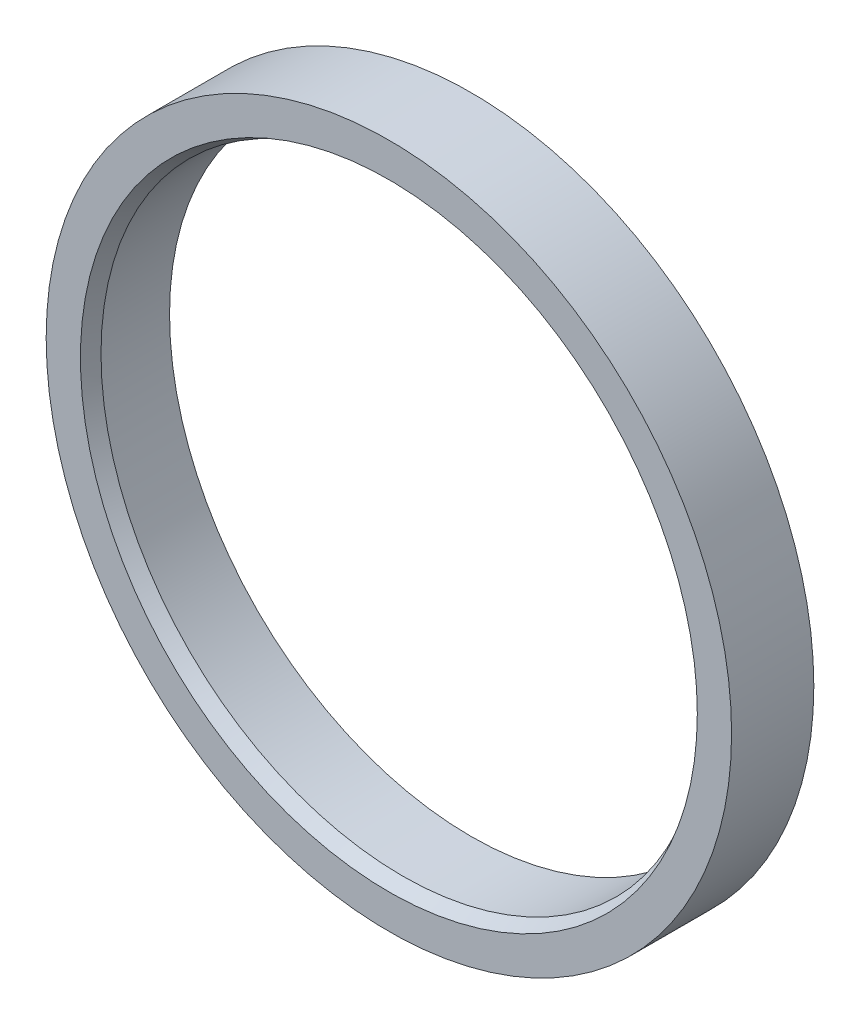
ISO-10303-21;
HEADER;
FILE_DESCRIPTION(('STEP AP214'),'2;1');
FILE_NAME('part.step','',(''),(''),'','','');
FILE_SCHEMA(('AUTOMOTIVE_DESIGN { 1 0 10303 214 1 1 1 1 }'));
ENDSEC;
DATA;
#1=APPLICATION_CONTEXT('core data for automotive mechanical design processes');
#2=APPLICATION_PROTOCOL_DEFINITION('international standard','automotive_design',2000,#1);
#3=PRODUCT_CONTEXT('',#1,'mechanical');
#4=PRODUCT('Part','Part','',(#3));
#5=PRODUCT_RELATED_PRODUCT_CATEGORY('part','',(#4));
#6=PRODUCT_DEFINITION_FORMATION('','',#4);
#7=PRODUCT_DEFINITION_CONTEXT('part definition',#1,'design');
#8=PRODUCT_DEFINITION('design','',#6,#7);
#9=PRODUCT_DEFINITION_SHAPE('','',#8);
#10=(LENGTH_UNIT() NAMED_UNIT(*) SI_UNIT(.MILLI.,.METRE.));
#11=(NAMED_UNIT(*) PLANE_ANGLE_UNIT() SI_UNIT($,.RADIAN.));
#12=(NAMED_UNIT(*) SI_UNIT($,.STERADIAN.) SOLID_ANGLE_UNIT());
#13=UNCERTAINTY_MEASURE_WITH_UNIT(LENGTH_MEASURE(1.E-05),#10,'distance_accuracy_value','');
#14=(GEOMETRIC_REPRESENTATION_CONTEXT(3) GLOBAL_UNCERTAINTY_ASSIGNED_CONTEXT((#13)) GLOBAL_UNIT_ASSIGNED_CONTEXT((#10,
#11,#12)) REPRESENTATION_CONTEXT('',''));
#15=CARTESIAN_POINT('',(0.,0.,0.));
#16=DIRECTION('',(0.,0.,1.));
#17=DIRECTION('',(1.,0.,0.));
#18=AXIS2_PLACEMENT_3D('',#15,#16,#17);
#19=CARTESIAN_POINT('',(0.,0.,-19.05));
#20=DIRECTION('',(0.,0.,-1.));
#21=DIRECTION('',(-1.,0.,0.));
#22=AXIS2_PLACEMENT_3D('',#19,#20,#21);
#23=PLANE('',#22);
#24=CARTESIAN_POINT('',(0.,0.,-19.05));
#25=DIRECTION('',(0.,0.,1.));
#26=DIRECTION('',(1.,0.,0.));
#27=AXIS2_PLACEMENT_3D('',#24,#25,#26);
#28=CIRCLE('',#27,69.85);
#29=CARTESIAN_POINT('',(69.85,0.,-19.05));
#30=VERTEX_POINT('',#29);
#31=EDGE_CURVE('E68',#30,#30,#28,.T.);
#32=ORIENTED_EDGE('',*,*,#31,.T.);
#33=EDGE_LOOP('',(#32));
#34=FACE_BOUND('',#33,.T.);
#35=CARTESIAN_POINT('',(0.,0.,-19.05));
#36=DIRECTION('',(0.,0.,1.));
#37=DIRECTION('',(1.,0.,0.));
#38=AXIS2_PLACEMENT_3D('',#35,#36,#37);
#39=CIRCLE('',#38,72.23125);
#40=CARTESIAN_POINT('',(72.23125,0.,-19.05));
#41=VERTEX_POINT('',#40);
#42=EDGE_CURVE('E10',#41,#41,#39,.T.);
#43=ORIENTED_EDGE('',*,*,#42,.F.);
#44=EDGE_LOOP('',(#43));
#45=FACE_BOUND('',#44,.T.);
#46=ADVANCED_FACE('F37',(#34,#45),#23,.T.);
#47=CARTESIAN_POINT('',(0.,0.,0.));
#48=DIRECTION('',(0.,0.,1.));
#49=DIRECTION('',(1.,0.,0.));
#50=AXIS2_PLACEMENT_3D('',#47,#48,#49);
#51=CYLINDRICAL_SURFACE('',#50,72.23125);
#52=ORIENTED_EDGE('',*,*,#42,.T.);
#53=EDGE_LOOP('',(#52));
#54=FACE_BOUND('',#53,.T.);
#55=CARTESIAN_POINT('',(0.,0.,-9.525));
#56=DIRECTION('',(0.,0.,1.));
#57=DIRECTION('',(1.,0.,0.));
#58=AXIS2_PLACEMENT_3D('',#55,#56,#57);
#59=CIRCLE('',#58,72.23125);
#60=CARTESIAN_POINT('',(72.23125,0.,-9.525));
#61=VERTEX_POINT('',#60);
#62=EDGE_CURVE('E43',#61,#61,#59,.T.);
#63=ORIENTED_EDGE('',*,*,#62,.F.);
#64=EDGE_LOOP('',(#63));
#65=FACE_BOUND('',#64,.T.);
#66=ADVANCED_FACE('F98',(#54,#65),#51,.T.);
#67=CARTESIAN_POINT('',(0.,0.,-9.525));
#68=DIRECTION('',(0.,0.,-1.));
#69=DIRECTION('',(-1.,0.,0.));
#70=AXIS2_PLACEMENT_3D('',#67,#68,#69);
#71=PLANE('',#70);
#72=ORIENTED_EDGE('',*,*,#62,.T.);
#73=EDGE_LOOP('',(#72));
#74=FACE_BOUND('',#73,.T.);
#75=CARTESIAN_POINT('',(0.,0.,-9.525));
#76=DIRECTION('',(0.,0.,1.));
#77=DIRECTION('',(1.,0.,0.));
#78=AXIS2_PLACEMENT_3D('',#75,#76,#77);
#79=CIRCLE('',#78,76.2);
#80=CARTESIAN_POINT('',(76.2,0.,-9.525));
#81=VERTEX_POINT('',#80);
#82=EDGE_CURVE('E47',#81,#81,#79,.T.);
#83=ORIENTED_EDGE('',*,*,#82,.F.);
#84=EDGE_LOOP('',(#83));
#85=FACE_BOUND('',#84,.T.);
#86=ADVANCED_FACE('F102',(#74,#85),#71,.T.);
#87=CARTESIAN_POINT('',(0.,0.,0.));
#88=DIRECTION('',(0.,0.,1.));
#89=DIRECTION('',(1.,0.,0.));
#90=AXIS2_PLACEMENT_3D('',#87,#88,#89);
#91=CYLINDRICAL_SURFACE('',#90,76.2);
#92=ORIENTED_EDGE('',*,*,#82,.T.);
#93=EDGE_LOOP('',(#92));
#94=FACE_BOUND('',#93,.T.);
#95=CARTESIAN_POINT('',(0.,0.,-19.05));
#96=DIRECTION('',(0.,0.,1.));
#97=DIRECTION('',(1.,0.,0.));
#98=AXIS2_PLACEMENT_3D('',#95,#96,#97);
#99=CIRCLE('',#98,76.2);
#100=CARTESIAN_POINT('',(76.2,0.,-19.05));
#101=VERTEX_POINT('',#100);
#102=EDGE_CURVE('E51',#101,#101,#99,.T.);
#103=ORIENTED_EDGE('',*,*,#102,.F.);
#104=EDGE_LOOP('',(#103));
#105=FACE_BOUND('',#104,.T.);
#106=ADVANCED_FACE('F106',(#94,#105),#91,.F.);
#107=CARTESIAN_POINT('',(0.,0.,-19.05));
#108=DIRECTION('',(0.,0.,-1.));
#109=DIRECTION('',(-1.,0.,0.));
#110=AXIS2_PLACEMENT_3D('',#107,#108,#109);
#111=PLANE('',#110);
#112=ORIENTED_EDGE('',*,*,#102,.T.);
#113=EDGE_LOOP('',(#112));
#114=FACE_BOUND('',#113,.T.);
#115=CARTESIAN_POINT('',(0.,0.,-19.05));
#116=DIRECTION('',(0.,0.,1.));
#117=DIRECTION('',(1.,0.,0.));
#118=AXIS2_PLACEMENT_3D('',#115,#116,#117);
#119=CIRCLE('',#118,79.375);
#120=CARTESIAN_POINT('',(79.375,0.,-19.05));
#121=VERTEX_POINT('',#120);
#122=EDGE_CURVE('E56',#121,#121,#119,.T.);
#123=ORIENTED_EDGE('',*,*,#122,.F.);
#124=EDGE_LOOP('',(#123));
#125=FACE_BOUND('',#124,.T.);
#126=ADVANCED_FACE('F94',(#114,#125),#111,.T.);
#127=CARTESIAN_POINT('',(0.,0.,0.));
#128=DIRECTION('',(0.,0.,1.));
#129=DIRECTION('',(1.,0.,0.));
#130=AXIS2_PLACEMENT_3D('',#127,#128,#129);
#131=CYLINDRICAL_SURFACE('',#130,79.375);
#132=ORIENTED_EDGE('',*,*,#122,.T.);
#133=EDGE_LOOP('',(#132));
#134=FACE_BOUND('',#133,.T.);
#135=CARTESIAN_POINT('',(0.,0.,0.));
#136=DIRECTION('',(0.,0.,1.));
#137=DIRECTION('',(1.,0.,0.));
#138=AXIS2_PLACEMENT_3D('',#135,#136,#137);
#139=CIRCLE('',#138,79.375);
#140=CARTESIAN_POINT('',(79.375,0.,0.));
#141=VERTEX_POINT('',#140);
#142=EDGE_CURVE('E59',#141,#141,#139,.T.);
#143=ORIENTED_EDGE('',*,*,#142,.F.);
#144=EDGE_LOOP('',(#143));
#145=FACE_BOUND('',#144,.T.);
#146=ADVANCED_FACE('F88',(#134,#145),#131,.T.);
#147=CARTESIAN_POINT('',(0.,0.,0.));
#148=DIRECTION('',(0.,0.,1.));
#149=DIRECTION('',(1.,0.,0.));
#150=AXIS2_PLACEMENT_3D('',#147,#148,#149);
#151=PLANE('',#150);
#152=ORIENTED_EDGE('',*,*,#142,.T.);
#153=EDGE_LOOP('',(#152));
#154=FACE_BOUND('',#153,.T.);
#155=CARTESIAN_POINT('',(0.,0.,0.));
#156=DIRECTION('',(0.,0.,1.));
#157=DIRECTION('',(1.,0.,0.));
#158=AXIS2_PLACEMENT_3D('',#155,#156,#157);
#159=CIRCLE('',#158,71.4375);
#160=CARTESIAN_POINT('',(71.4375,0.,0.));
#161=VERTEX_POINT('',#160);
#162=EDGE_CURVE('E62',#161,#161,#159,.T.);
#163=ORIENTED_EDGE('',*,*,#162,.F.);
#164=EDGE_LOOP('',(#163));
#165=FACE_BOUND('',#164,.T.);
#166=ADVANCED_FACE('F83',(#154,#165),#151,.T.);
#167=CARTESIAN_POINT('',(0.,0.,0.));
#168=DIRECTION('',(0.,0.,1.));
#169=DIRECTION('',(1.,0.,0.));
#170=AXIS2_PLACEMENT_3D('',#167,#168,#169);
#171=CONICAL_SURFACE('',#170,71.4375,0.463647609000811);
#172=CARTESIAN_POINT('',(0.,0.,-3.175));
#173=DIRECTION('',(0.,0.,1.));
#174=DIRECTION('',(1.,0.,0.));
#175=AXIS2_PLACEMENT_3D('',#172,#173,#174);
#176=CIRCLE('',#175,69.85);
#177=CARTESIAN_POINT('',(69.85,0.,-3.175));
#178=VERTEX_POINT('',#177);
#179=EDGE_CURVE('E65',#178,#178,#176,.T.);
#180=ORIENTED_EDGE('',*,*,#179,.F.);
#181=EDGE_LOOP('',(#180));
#182=FACE_BOUND('',#181,.T.);
#183=ORIENTED_EDGE('',*,*,#162,.T.);
#184=EDGE_LOOP('',(#183));
#185=FACE_BOUND('',#184,.T.);
#186=ADVANCED_FACE('F77',(#182,#185),#171,.F.);
#187=CARTESIAN_POINT('',(0.,0.,0.));
#188=DIRECTION('',(0.,0.,1.));
#189=DIRECTION('',(1.,0.,0.));
#190=AXIS2_PLACEMENT_3D('',#187,#188,#189);
#191=CYLINDRICAL_SURFACE('',#190,69.85);
#192=ORIENTED_EDGE('',*,*,#31,.F.);
#193=EDGE_LOOP('',(#192));
#194=FACE_BOUND('',#193,.T.);
#195=ORIENTED_EDGE('',*,*,#179,.T.);
#196=EDGE_LOOP('',(#195));
#197=FACE_BOUND('',#196,.T.);
#198=ADVANCED_FACE('F74',(#194,#197),#191,.F.);
#199=CLOSED_SHELL('',(#46,#66,#86,#106,#126,#146,#166,#186,#198));
#200=MANIFOLD_SOLID_BREP('B2',#199);
#201=ADVANCED_BREP_SHAPE_REPRESENTATION('',(#18,#200),#14);
#202=SHAPE_DEFINITION_REPRESENTATION(#9,#201);
ENDSEC;
END-ISO-10303-21;
